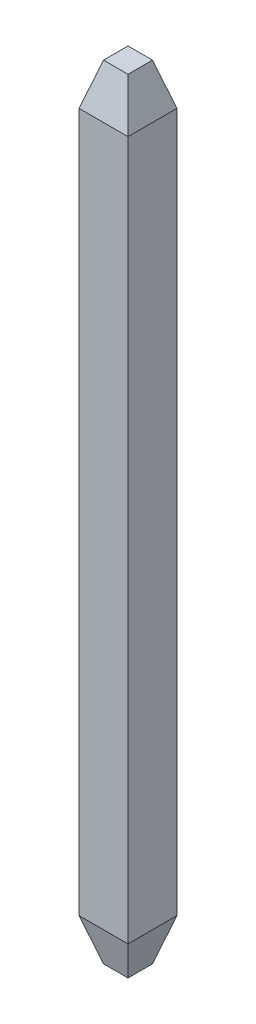
ISO-10303-21;
HEADER;
FILE_DESCRIPTION(('STEP AP214'),'2;1');
FILE_NAME('part.step','',(''),(''),'','','');
FILE_SCHEMA(('AUTOMOTIVE_DESIGN { 1 0 10303 214 1 1 1 1 }'));
ENDSEC;
DATA;
#1=APPLICATION_CONTEXT('core data for automotive mechanical design processes');
#2=APPLICATION_PROTOCOL_DEFINITION('international standard','automotive_design',2000,#1);
#3=PRODUCT_CONTEXT('',#1,'mechanical');
#4=PRODUCT('Part','Part','',(#3));
#5=PRODUCT_RELATED_PRODUCT_CATEGORY('part','',(#4));
#6=PRODUCT_DEFINITION_FORMATION('','',#4);
#7=PRODUCT_DEFINITION_CONTEXT('part definition',#1,'design');
#8=PRODUCT_DEFINITION('design','',#6,#7);
#9=PRODUCT_DEFINITION_SHAPE('','',#8);
#10=(LENGTH_UNIT() NAMED_UNIT(*) SI_UNIT(.MILLI.,.METRE.));
#11=(NAMED_UNIT(*) PLANE_ANGLE_UNIT() SI_UNIT($,.RADIAN.));
#12=(NAMED_UNIT(*) SI_UNIT($,.STERADIAN.) SOLID_ANGLE_UNIT());
#13=UNCERTAINTY_MEASURE_WITH_UNIT(LENGTH_MEASURE(1.E-05),#10,'distance_accuracy_value','');
#14=(GEOMETRIC_REPRESENTATION_CONTEXT(3) GLOBAL_UNCERTAINTY_ASSIGNED_CONTEXT((#13)) GLOBAL_UNIT_ASSIGNED_CONTEXT((#10,
#11,#12)) REPRESENTATION_CONTEXT('',''));
#15=CARTESIAN_POINT('',(0.,0.,0.));
#16=DIRECTION('',(0.,0.,1.));
#17=DIRECTION('',(1.,0.,0.));
#18=AXIS2_PLACEMENT_3D('',#15,#16,#17);
#19=CARTESIAN_POINT('',(-21.749999999987,-5.53543505344796,-16.6589999999763));
#20=DIRECTION('',(-1.,0.,0.));
#21=DIRECTION('',(0.,0.,1.));
#22=AXIS2_PLACEMENT_3D('',#19,#20,#21);
#23=PLANE('',#22);
#24=DIRECTION('',(0.,1.,0.));
#25=VECTOR('',#24,1.);
#26=CARTESIAN_POINT('',(-21.749999999987,-10.1039999999832,-17.2999999999763));
#27=LINE('',#26,#25);
#28=CARTESIAN_POINT('',(-21.749999999987,-10.1039999999832,-17.2999999999763));
#29=VERTEX_POINT('',#28);
#30=CARTESIAN_POINT('',(-21.749999999987,-0.965870106912723,-17.2999999999763));
#31=VERTEX_POINT('',#30);
#32=EDGE_CURVE('E154',#29,#31,#27,.T.);
#33=ORIENTED_EDGE('',*,*,#32,.F.);
#34=DIRECTION('',(0.,0.,-1.));
#35=VECTOR('',#34,1.);
#36=CARTESIAN_POINT('',(-21.749999999987,-10.1039999999832,-16.6599999999763));
#37=LINE('',#36,#35);
#38=CARTESIAN_POINT('',(-21.749999999987,-10.1039999999832,-16.6599999999763));
#39=VERTEX_POINT('',#38);
#40=EDGE_CURVE('E42',#39,#29,#37,.T.);
#41=ORIENTED_EDGE('',*,*,#40,.F.);
#42=DIRECTION('',(0.,1.,0.));
#43=VECTOR('',#42,1.);
#44=CARTESIAN_POINT('',(-21.749999999987,-10.1039999999832,-16.6599999999763));
#45=LINE('',#44,#43);
#46=CARTESIAN_POINT('',(-21.749999999987,-0.965870106912723,-16.6599999999763));
#47=VERTEX_POINT('',#46);
#48=EDGE_CURVE('E11',#39,#47,#45,.T.);
#49=ORIENTED_EDGE('',*,*,#48,.T.);
#50=DIRECTION('',(0.,0.,-1.));
#51=VECTOR('',#50,1.);
#52=CARTESIAN_POINT('',(-21.749999999987,-0.965870106912721,-16.6599999999763));
#53=LINE('',#52,#51);
#54=EDGE_CURVE('E28',#47,#31,#53,.T.);
#55=ORIENTED_EDGE('',*,*,#54,.T.);
#56=EDGE_LOOP('',(#33,#41,#49,#55));
#57=FACE_BOUND('',#56,.T.);
#58=ADVANCED_FACE('F17',(#57),#23,.T.);
#59=CARTESIAN_POINT('',(-21.108999999987,-5.53443505344796,-17.2999999999763));
#60=DIRECTION('',(0.,0.,-1.));
#61=DIRECTION('',(0.,-1.,0.));
#62=AXIS2_PLACEMENT_3D('',#59,#60,#61);
#63=PLANE('',#62);
#64=DIRECTION('',(0.,1.,0.));
#65=VECTOR('',#64,1.);
#66=CARTESIAN_POINT('',(-21.109999999987,-10.1039999999832,-17.2999999999763));
#67=LINE('',#66,#65);
#68=CARTESIAN_POINT('',(-21.109999999987,-10.1039999999832,-17.2999999999763));
#69=VERTEX_POINT('',#68);
#70=CARTESIAN_POINT('',(-21.109999999987,-0.965870106912723,-17.2999999999763));
#71=VERTEX_POINT('',#70);
#72=EDGE_CURVE('E173',#69,#71,#67,.T.);
#73=ORIENTED_EDGE('',*,*,#72,.F.);
#74=DIRECTION('',(1.,0.,0.));
#75=VECTOR('',#74,1.);
#76=CARTESIAN_POINT('',(-21.749999999987,-10.1039999999832,-17.2999999999763));
#77=LINE('',#76,#75);
#78=EDGE_CURVE('E112',#29,#69,#77,.T.);
#79=ORIENTED_EDGE('',*,*,#78,.F.);
#80=ORIENTED_EDGE('',*,*,#32,.T.);
#81=DIRECTION('',(1.,0.,0.));
#82=VECTOR('',#81,1.);
#83=CARTESIAN_POINT('',(-21.749999999987,-0.965870106912721,-17.2999999999763));
#84=LINE('',#83,#82);
#85=EDGE_CURVE('E21',#31,#71,#84,.T.);
#86=ORIENTED_EDGE('',*,*,#85,.T.);
#87=EDGE_LOOP('',(#73,#79,#80,#86));
#88=FACE_BOUND('',#87,.T.);
#89=ADVANCED_FACE('F234',(#88),#63,.T.);
#90=CARTESIAN_POINT('',(-21.109999999987,-11.0738701069127,-16.9799999999763));
#91=DIRECTION('',(1.,0.,0.));
#92=DIRECTION('',(0.,1.,0.));
#93=AXIS2_PLACEMENT_3D('',#90,#91,#92);
#94=PLANE('',#93);
#95=DIRECTION('',(0.,1.,0.));
#96=VECTOR('',#95,1.);
#97=CARTESIAN_POINT('',(-21.109999999987,-10.1039999999832,-16.6599999999763));
#98=LINE('',#97,#96);
#99=CARTESIAN_POINT('',(-21.109999999987,-10.1039999999832,-16.6599999999763));
#100=VERTEX_POINT('',#99);
#101=CARTESIAN_POINT('',(-21.109999999987,-0.965870106912723,-16.6599999999763));
#102=VERTEX_POINT('',#101);
#103=EDGE_CURVE('E149',#100,#102,#98,.T.);
#104=ORIENTED_EDGE('',*,*,#103,.F.);
#105=DIRECTION('',(0.,0.,1.));
#106=VECTOR('',#105,1.);
#107=CARTESIAN_POINT('',(-21.109999999987,-10.1039999999832,-17.2999999999763));
#108=LINE('',#107,#106);
#109=EDGE_CURVE('E196',#69,#100,#108,.T.);
#110=ORIENTED_EDGE('',*,*,#109,.F.);
#111=ORIENTED_EDGE('',*,*,#72,.T.);
#112=DIRECTION('',(0.,0.,1.));
#113=VECTOR('',#112,1.);
#114=CARTESIAN_POINT('',(-21.109999999987,-0.965870106912721,-17.2999999999763));
#115=LINE('',#114,#113);
#116=EDGE_CURVE('E188',#71,#102,#115,.T.);
#117=ORIENTED_EDGE('',*,*,#116,.T.);
#118=EDGE_LOOP('',(#104,#110,#111,#117));
#119=FACE_BOUND('',#118,.T.);
#120=ADVANCED_FACE('F240',(#119),#94,.T.);
#121=CARTESIAN_POINT('',(-21.109999999987,-0.965870106912721,-16.9799999999763));
#122=DIRECTION('',(0.959644900900968,0.281214622974643,0.));
#123=DIRECTION('',(0.,0.,-1.));
#124=AXIS2_PLACEMENT_3D('',#121,#122,#123);
#125=PLANE('',#124);
#126=DIRECTION('',(-0.270714017147727,0.923811583516617,0.270714017147727));
#127=VECTOR('',#126,1.);
#128=CARTESIAN_POINT('',(-21.109999999987,-0.965870106912721,-17.2999999999763));
#129=LINE('',#128,#127);
#130=CARTESIAN_POINT('',(-21.269999999987,-0.419870106912724,-17.1399999999763));
#131=VERTEX_POINT('',#130);
#132=EDGE_CURVE('E192',#71,#131,#129,.T.);
#133=ORIENTED_EDGE('',*,*,#132,.T.);
#134=DIRECTION('',(0.,0.,1.));
#135=VECTOR('',#134,1.);
#136=CARTESIAN_POINT('',(-21.269999999987,-0.419870106912722,-17.1399999999763));
#137=LINE('',#136,#135);
#138=CARTESIAN_POINT('',(-21.269999999987,-0.419870106912724,-16.8199999999763));
#139=VERTEX_POINT('',#138);
#140=EDGE_CURVE('E180',#131,#139,#137,.T.);
#141=ORIENTED_EDGE('',*,*,#140,.T.);
#142=DIRECTION('',(-0.270714017147727,0.923811583516617,-0.270714017147727));
#143=VECTOR('',#142,1.);
#144=CARTESIAN_POINT('',(-21.109999999987,-0.965870106912721,-16.6599999999763));
#145=LINE('',#144,#143);
#146=EDGE_CURVE('E178',#102,#139,#145,.T.);
#147=ORIENTED_EDGE('',*,*,#146,.F.);
#148=ORIENTED_EDGE('',*,*,#116,.F.);
#149=EDGE_LOOP('',(#133,#141,#147,#148));
#150=FACE_BOUND('',#149,.T.);
#151=ADVANCED_FACE('F248',(#150),#125,.T.);
#152=CARTESIAN_POINT('',(-21.429999999987,-0.965870106912721,-16.6599999999763));
#153=DIRECTION('',(0.,0.281214622974643,0.959644900900968));
#154=DIRECTION('',(1.,0.,0.));
#155=AXIS2_PLACEMENT_3D('',#152,#153,#154);
#156=PLANE('',#155);
#157=ORIENTED_EDGE('',*,*,#146,.T.);
#158=DIRECTION('',(-1.,0.,0.));
#159=VECTOR('',#158,1.);
#160=CARTESIAN_POINT('',(-21.269999999987,-0.419870106912722,-16.8199999999763));
#161=LINE('',#160,#159);
#162=CARTESIAN_POINT('',(-21.589999999987,-0.419870106912724,-16.8199999999763));
#163=VERTEX_POINT('',#162);
#164=EDGE_CURVE('E181',#139,#163,#161,.T.);
#165=ORIENTED_EDGE('',*,*,#164,.T.);
#166=DIRECTION('',(0.270714017147727,0.923811583516617,-0.270714017147727));
#167=VECTOR('',#166,1.);
#168=CARTESIAN_POINT('',(-21.749999999987,-0.965870106912721,-16.6599999999763));
#169=LINE('',#168,#167);
#170=EDGE_CURVE('E117',#47,#163,#169,.T.);
#171=ORIENTED_EDGE('',*,*,#170,.F.);
#172=DIRECTION('',(-1.,0.,0.));
#173=VECTOR('',#172,1.);
#174=CARTESIAN_POINT('',(-21.109999999987,-0.965870106912721,-16.6599999999763));
#175=LINE('',#174,#173);
#176=EDGE_CURVE('E153',#102,#47,#175,.T.);
#177=ORIENTED_EDGE('',*,*,#176,.F.);
#178=EDGE_LOOP('',(#157,#165,#171,#177));
#179=FACE_BOUND('',#178,.T.);
#180=ADVANCED_FACE('F245',(#179),#156,.T.);
#181=CARTESIAN_POINT('',(-21.429999999987,-0.419870106912722,-17.1409999999763));
#182=DIRECTION('',(0.,1.,0.));
#183=DIRECTION('',(1.,0.,0.));
#184=AXIS2_PLACEMENT_3D('',#181,#182,#183);
#185=PLANE('',#184);
#186=DIRECTION('',(1.,0.,0.));
#187=VECTOR('',#186,1.);
#188=CARTESIAN_POINT('',(-21.589999999987,-0.419870106912722,-17.1399999999763));
#189=LINE('',#188,#187);
#190=CARTESIAN_POINT('',(-21.589999999987,-0.419870106912724,-17.1399999999763));
#191=VERTEX_POINT('',#190);
#192=EDGE_CURVE('E148',#191,#131,#189,.T.);
#193=ORIENTED_EDGE('',*,*,#192,.F.);
#194=DIRECTION('',(0.,0.,-1.));
#195=VECTOR('',#194,1.);
#196=CARTESIAN_POINT('',(-21.589999999987,-0.419870106912722,-16.8199999999763));
#197=LINE('',#196,#195);
#198=EDGE_CURVE('E152',#163,#191,#197,.T.);
#199=ORIENTED_EDGE('',*,*,#198,.F.);
#200=ORIENTED_EDGE('',*,*,#164,.F.);
#201=ORIENTED_EDGE('',*,*,#140,.F.);
#202=EDGE_LOOP('',(#193,#199,#200,#201));
#203=FACE_BOUND('',#202,.T.);
#204=ADVANCED_FACE('F19',(#203),#185,.T.);
#205=CARTESIAN_POINT('',(-21.109999999987,-10.1039999999832,-16.9799999999763));
#206=DIRECTION('',(0.959644900900968,-0.281214622974643,0.));
#207=DIRECTION('',(0.,0.,-1.));
#208=AXIS2_PLACEMENT_3D('',#205,#206,#207);
#209=PLANE('',#208);
#210=ORIENTED_EDGE('',*,*,#109,.T.);
#211=DIRECTION('',(-0.270714017147727,-0.923811583516618,-0.270714017147727));
#212=VECTOR('',#211,1.);
#213=CARTESIAN_POINT('',(-21.109999999987,-10.1039999999832,-16.6599999999763));
#214=LINE('',#213,#212);
#215=CARTESIAN_POINT('',(-21.269999999987,-10.6499999999832,-16.8199999999763));
#216=VERTEX_POINT('',#215);
#217=EDGE_CURVE('E122',#100,#216,#214,.T.);
#218=ORIENTED_EDGE('',*,*,#217,.T.);
#219=DIRECTION('',(0.,0.,1.));
#220=VECTOR('',#219,1.);
#221=CARTESIAN_POINT('',(-21.269999999987,-10.6499999999832,-17.1399999999763));
#222=LINE('',#221,#220);
#223=CARTESIAN_POINT('',(-21.269999999987,-10.6499999999832,-17.1399999999763));
#224=VERTEX_POINT('',#223);
#225=EDGE_CURVE('E119',#224,#216,#222,.T.);
#226=ORIENTED_EDGE('',*,*,#225,.F.);
#227=DIRECTION('',(-0.270714017147727,-0.923811583516618,0.270714017147727));
#228=VECTOR('',#227,1.);
#229=CARTESIAN_POINT('',(-21.109999999987,-10.1039999999832,-17.2999999999763));
#230=LINE('',#229,#228);
#231=EDGE_CURVE('E106',#69,#224,#230,.T.);
#232=ORIENTED_EDGE('',*,*,#231,.F.);
#233=EDGE_LOOP('',(#210,#218,#226,#232));
#234=FACE_BOUND('',#233,.T.);
#235=ADVANCED_FACE('F120',(#234),#209,.T.);
#236=CARTESIAN_POINT('',(-21.590999999987,-10.6499999999832,-16.9799999999763));
#237=DIRECTION('',(0.,-1.,0.));
#238=DIRECTION('',(0.,0.,-1.));
#239=AXIS2_PLACEMENT_3D('',#236,#237,#238);
#240=PLANE('',#239);
#241=ORIENTED_EDGE('',*,*,#225,.T.);
#242=DIRECTION('',(-1.,0.,0.));
#243=VECTOR('',#242,1.);
#244=CARTESIAN_POINT('',(-21.269999999987,-10.6499999999832,-16.8199999999763));
#245=LINE('',#244,#243);
#246=CARTESIAN_POINT('',(-21.589999999987,-10.6499999999832,-16.8199999999763));
#247=VERTEX_POINT('',#246);
#248=EDGE_CURVE('E126',#216,#247,#245,.T.);
#249=ORIENTED_EDGE('',*,*,#248,.T.);
#250=DIRECTION('',(0.,0.,-1.));
#251=VECTOR('',#250,1.);
#252=CARTESIAN_POINT('',(-21.589999999987,-10.6499999999832,-16.8199999999763));
#253=LINE('',#252,#251);
#254=CARTESIAN_POINT('',(-21.589999999987,-10.6499999999832,-17.1399999999763));
#255=VERTEX_POINT('',#254);
#256=EDGE_CURVE('E99',#247,#255,#253,.T.);
#257=ORIENTED_EDGE('',*,*,#256,.T.);
#258=DIRECTION('',(1.,0.,0.));
#259=VECTOR('',#258,1.);
#260=CARTESIAN_POINT('',(-21.589999999987,-10.6499999999832,-17.1399999999763));
#261=LINE('',#260,#259);
#262=EDGE_CURVE('E111',#255,#224,#261,.T.);
#263=ORIENTED_EDGE('',*,*,#262,.T.);
#264=EDGE_LOOP('',(#241,#249,#257,#263));
#265=FACE_BOUND('',#264,.T.);
#266=ADVANCED_FACE('F128',(#265),#240,.T.);
#267=CARTESIAN_POINT('',(-21.429999999987,-10.1039999999832,-16.6599999999763));
#268=DIRECTION('',(0.,-0.281214622974643,0.959644900900968));
#269=DIRECTION('',(-1.,0.,0.));
#270=AXIS2_PLACEMENT_3D('',#267,#268,#269);
#271=PLANE('',#270);
#272=DIRECTION('',(-1.,0.,0.));
#273=VECTOR('',#272,1.);
#274=CARTESIAN_POINT('',(-21.109999999987,-10.1039999999832,-16.6599999999763));
#275=LINE('',#274,#273);
#276=EDGE_CURVE('E130',#100,#39,#275,.T.);
#277=ORIENTED_EDGE('',*,*,#276,.T.);
#278=DIRECTION('',(0.270714017147727,-0.923811583516618,-0.270714017147727));
#279=VECTOR('',#278,1.);
#280=CARTESIAN_POINT('',(-21.749999999987,-10.1039999999832,-16.6599999999763));
#281=LINE('',#280,#279);
#282=EDGE_CURVE('E139',#39,#247,#281,.T.);
#283=ORIENTED_EDGE('',*,*,#282,.T.);
#284=ORIENTED_EDGE('',*,*,#248,.F.);
#285=ORIENTED_EDGE('',*,*,#217,.F.);
#286=EDGE_LOOP('',(#277,#283,#284,#285));
#287=FACE_BOUND('',#286,.T.);
#288=ADVANCED_FACE('F218',(#287),#271,.T.);
#289=CARTESIAN_POINT('',(-21.429999999987,-0.965870106912721,-17.2999999999763));
#290=DIRECTION('',(0.,0.281214622974643,-0.959644900900968));
#291=DIRECTION('',(-1.,0.,0.));
#292=AXIS2_PLACEMENT_3D('',#289,#290,#291);
#293=PLANE('',#292);
#294=DIRECTION('',(0.270714017147727,0.923811583516617,0.270714017147727));
#295=VECTOR('',#294,1.);
#296=CARTESIAN_POINT('',(-21.749999999987,-0.965870106912721,-17.2999999999763));
#297=LINE('',#296,#295);
#298=EDGE_CURVE('E144',#31,#191,#297,.T.);
#299=ORIENTED_EDGE('',*,*,#298,.T.);
#300=ORIENTED_EDGE('',*,*,#192,.T.);
#301=ORIENTED_EDGE('',*,*,#132,.F.);
#302=ORIENTED_EDGE('',*,*,#85,.F.);
#303=EDGE_LOOP('',(#299,#300,#301,#302));
#304=FACE_BOUND('',#303,.T.);
#305=ADVANCED_FACE('F249',(#304),#293,.T.);
#306=CARTESIAN_POINT('',(-21.429999999987,-10.1039999999832,-17.2999999999763));
#307=DIRECTION('',(0.,-0.281214622974643,-0.959644900900968));
#308=DIRECTION('',(0.,-0.959644900900968,0.281214622974643));
#309=AXIS2_PLACEMENT_3D('',#306,#307,#308);
#310=PLANE('',#309);
#311=ORIENTED_EDGE('',*,*,#78,.T.);
#312=ORIENTED_EDGE('',*,*,#231,.T.);
#313=ORIENTED_EDGE('',*,*,#262,.F.);
#314=DIRECTION('',(0.270714017147727,-0.923811583516618,0.270714017147727));
#315=VECTOR('',#314,1.);
#316=CARTESIAN_POINT('',(-21.749999999987,-10.1039999999832,-17.2999999999763));
#317=LINE('',#316,#315);
#318=EDGE_CURVE('E175',#29,#255,#317,.T.);
#319=ORIENTED_EDGE('',*,*,#318,.F.);
#320=EDGE_LOOP('',(#311,#312,#313,#319));
#321=FACE_BOUND('',#320,.T.);
#322=ADVANCED_FACE('F108',(#321),#310,.T.);
#323=CARTESIAN_POINT('',(-21.749999999987,-0.965870106912721,-16.9799999999763));
#324=DIRECTION('',(-0.959644900900968,0.281214622974643,0.));
#325=DIRECTION('',(0.,0.,1.));
#326=AXIS2_PLACEMENT_3D('',#323,#324,#325);
#327=PLANE('',#326);
#328=ORIENTED_EDGE('',*,*,#170,.T.);
#329=ORIENTED_EDGE('',*,*,#198,.T.);
#330=ORIENTED_EDGE('',*,*,#298,.F.);
#331=ORIENTED_EDGE('',*,*,#54,.F.);
#332=EDGE_LOOP('',(#328,#329,#330,#331));
#333=FACE_BOUND('',#332,.T.);
#334=ADVANCED_FACE('F229',(#333),#327,.T.);
#335=CARTESIAN_POINT('',(-21.750999999987,-5.53543505344796,-16.6599999999763));
#336=DIRECTION('',(0.,0.,1.));
#337=DIRECTION('',(1.,0.,0.));
#338=AXIS2_PLACEMENT_3D('',#335,#336,#337);
#339=PLANE('',#338);
#340=ORIENTED_EDGE('',*,*,#48,.F.);
#341=ORIENTED_EDGE('',*,*,#276,.F.);
#342=ORIENTED_EDGE('',*,*,#103,.T.);
#343=ORIENTED_EDGE('',*,*,#176,.T.);
#344=EDGE_LOOP('',(#340,#341,#342,#343));
#345=FACE_BOUND('',#344,.T.);
#346=ADVANCED_FACE('F222',(#345),#339,.T.);
#347=CARTESIAN_POINT('',(-21.749999999987,-10.1039999999832,-16.9799999999763));
#348=DIRECTION('',(-0.959644900900968,-0.281214622974643,0.));
#349=DIRECTION('',(-0.281214622974643,0.959644900900968,0.));
#350=AXIS2_PLACEMENT_3D('',#347,#348,#349);
#351=PLANE('',#350);
#352=ORIENTED_EDGE('',*,*,#40,.T.);
#353=ORIENTED_EDGE('',*,*,#318,.T.);
#354=ORIENTED_EDGE('',*,*,#256,.F.);
#355=ORIENTED_EDGE('',*,*,#282,.F.);
#356=EDGE_LOOP('',(#352,#353,#354,#355));
#357=FACE_BOUND('',#356,.T.);
#358=ADVANCED_FACE('F220',(#357),#351,.T.);
#359=CLOSED_SHELL('',(#58,#89,#120,#151,#180,#204,#235,#266,#288,#305,#322,#334,#346,#358));
#360=MANIFOLD_SOLID_BREP('B1',#359);
#361=ADVANCED_BREP_SHAPE_REPRESENTATION('',(#18,#360),#14);
#362=SHAPE_DEFINITION_REPRESENTATION(#9,#361);
ENDSEC;
END-ISO-10303-21;
